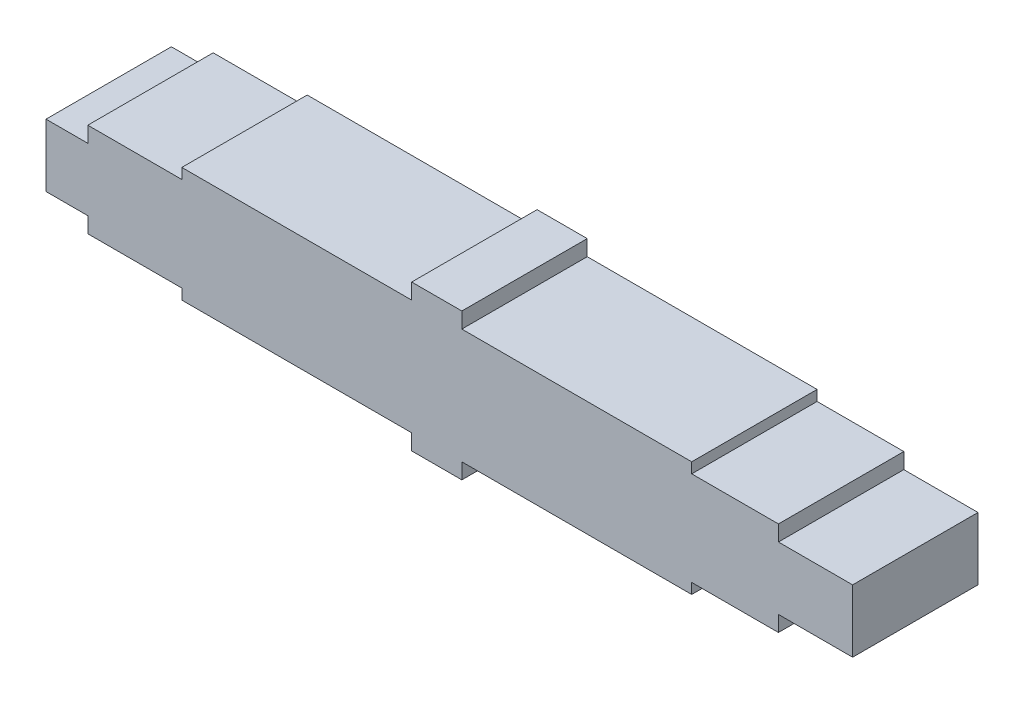
ISO-10303-21;
HEADER;
FILE_DESCRIPTION(('STEP AP214'),'2;1');
FILE_NAME('part.step','',(''),(''),'','','');
FILE_SCHEMA(('AUTOMOTIVE_DESIGN { 1 0 10303 214 1 1 1 1 }'));
ENDSEC;
DATA;
#1=APPLICATION_CONTEXT('core data for automotive mechanical design processes');
#2=APPLICATION_PROTOCOL_DEFINITION('international standard','automotive_design',2000,#1);
#3=PRODUCT_CONTEXT('',#1,'mechanical');
#4=PRODUCT('Part','Part','',(#3));
#5=PRODUCT_RELATED_PRODUCT_CATEGORY('part','',(#4));
#6=PRODUCT_DEFINITION_FORMATION('','',#4);
#7=PRODUCT_DEFINITION_CONTEXT('part definition',#1,'design');
#8=PRODUCT_DEFINITION('design','',#6,#7);
#9=PRODUCT_DEFINITION_SHAPE('','',#8);
#10=(LENGTH_UNIT() NAMED_UNIT(*) SI_UNIT(.MILLI.,.METRE.));
#11=(NAMED_UNIT(*) PLANE_ANGLE_UNIT() SI_UNIT($,.RADIAN.));
#12=(NAMED_UNIT(*) SI_UNIT($,.STERADIAN.) SOLID_ANGLE_UNIT());
#13=UNCERTAINTY_MEASURE_WITH_UNIT(LENGTH_MEASURE(1.E-05),#10,'distance_accuracy_value','');
#14=(GEOMETRIC_REPRESENTATION_CONTEXT(3) GLOBAL_UNCERTAINTY_ASSIGNED_CONTEXT((#13)) GLOBAL_UNIT_ASSIGNED_CONTEXT((#10,
#11,#12)) REPRESENTATION_CONTEXT('',''));
#15=CARTESIAN_POINT('',(0.,0.,0.));
#16=DIRECTION('',(0.,0.,1.));
#17=DIRECTION('',(1.,0.,0.));
#18=AXIS2_PLACEMENT_3D('',#15,#16,#17);
#19=CARTESIAN_POINT('',(53.,22.5,-30.));
#20=DIRECTION('',(1.,0.,0.));
#21=DIRECTION('',(0.,0.,-1.));
#22=AXIS2_PLACEMENT_3D('',#19,#20,#21);
#23=PLANE('',#22);
#24=DIRECTION('',(0.,0.,1.));
#25=VECTOR('',#24,1.);
#26=CARTESIAN_POINT('',(53.,22.5,-30.));
#27=LINE('',#26,#25);
#28=CARTESIAN_POINT('',(53.,22.5,-30.));
#29=VERTEX_POINT('',#28);
#30=CARTESIAN_POINT('',(53.,22.5,30.));
#31=VERTEX_POINT('',#30);
#32=EDGE_CURVE('E398',#29,#31,#27,.T.);
#33=ORIENTED_EDGE('',*,*,#32,.T.);
#34=DIRECTION('',(0.,1.,0.));
#35=VECTOR('',#34,1.);
#36=CARTESIAN_POINT('',(53.,22.5,30.));
#37=LINE('',#36,#35);
#38=CARTESIAN_POINT('',(53.,27.5,30.));
#39=VERTEX_POINT('',#38);
#40=EDGE_CURVE('E247',#31,#39,#37,.T.);
#41=ORIENTED_EDGE('',*,*,#40,.T.);
#42=DIRECTION('',(0.,0.,1.));
#43=VECTOR('',#42,1.);
#44=CARTESIAN_POINT('',(53.,27.5,-30.));
#45=LINE('',#44,#43);
#46=CARTESIAN_POINT('',(53.,27.5,-30.));
#47=VERTEX_POINT('',#46);
#48=EDGE_CURVE('E11',#47,#39,#45,.T.);
#49=ORIENTED_EDGE('',*,*,#48,.F.);
#50=DIRECTION('',(0.,1.,0.));
#51=VECTOR('',#50,1.);
#52=CARTESIAN_POINT('',(53.,22.5,-30.));
#53=LINE('',#52,#51);
#54=EDGE_CURVE('E331',#29,#47,#53,.T.);
#55=ORIENTED_EDGE('',*,*,#54,.F.);
#56=EDGE_LOOP('',(#33,#41,#49,#55));
#57=FACE_BOUND('',#56,.T.);
#58=ADVANCED_FACE('F34',(#57),#23,.F.);
#59=CARTESIAN_POINT('',(53.,27.5,-30.));
#60=DIRECTION('',(0.,-1.,0.));
#61=DIRECTION('',(0.,0.,-1.));
#62=AXIS2_PLACEMENT_3D('',#59,#60,#61);
#63=PLANE('',#62);
#64=ORIENTED_EDGE('',*,*,#48,.T.);
#65=DIRECTION('',(1.,0.,0.));
#66=VECTOR('',#65,1.);
#67=CARTESIAN_POINT('',(53.,27.5,30.));
#68=LINE('',#67,#66);
#69=CARTESIAN_POINT('',(163.,27.5,30.));
#70=VERTEX_POINT('',#69);
#71=EDGE_CURVE('E250',#39,#70,#68,.T.);
#72=ORIENTED_EDGE('',*,*,#71,.T.);
#73=DIRECTION('',(0.,0.,1.));
#74=VECTOR('',#73,1.);
#75=CARTESIAN_POINT('',(163.,27.5,-30.));
#76=LINE('',#75,#74);
#77=CARTESIAN_POINT('',(163.,27.5,-30.));
#78=VERTEX_POINT('',#77);
#79=EDGE_CURVE('E41',#78,#70,#76,.T.);
#80=ORIENTED_EDGE('',*,*,#79,.F.);
#81=DIRECTION('',(1.,0.,0.));
#82=VECTOR('',#81,1.);
#83=CARTESIAN_POINT('',(53.,27.5,-30.));
#84=LINE('',#83,#82);
#85=EDGE_CURVE('E333',#47,#78,#84,.T.);
#86=ORIENTED_EDGE('',*,*,#85,.F.);
#87=EDGE_LOOP('',(#64,#72,#80,#86));
#88=FACE_BOUND('',#87,.T.);
#89=ADVANCED_FACE('F462',(#88),#63,.F.);
#90=CARTESIAN_POINT('',(163.,27.5,-30.));
#91=DIRECTION('',(1.,0.,0.));
#92=DIRECTION('',(0.,0.,-1.));
#93=AXIS2_PLACEMENT_3D('',#90,#91,#92);
#94=PLANE('',#93);
#95=ORIENTED_EDGE('',*,*,#79,.T.);
#96=DIRECTION('',(0.,1.,0.));
#97=VECTOR('',#96,1.);
#98=CARTESIAN_POINT('',(163.,27.5,30.));
#99=LINE('',#98,#97);
#100=CARTESIAN_POINT('',(163.,35.,30.));
#101=VERTEX_POINT('',#100);
#102=EDGE_CURVE('E253',#70,#101,#99,.T.);
#103=ORIENTED_EDGE('',*,*,#102,.T.);
#104=DIRECTION('',(0.,0.,1.));
#105=VECTOR('',#104,1.);
#106=CARTESIAN_POINT('',(163.,35.,-30.));
#107=LINE('',#106,#105);
#108=CARTESIAN_POINT('',(163.,35.,-30.));
#109=VERTEX_POINT('',#108);
#110=EDGE_CURVE('E448',#109,#101,#107,.T.);
#111=ORIENTED_EDGE('',*,*,#110,.F.);
#112=DIRECTION('',(0.,1.,0.));
#113=VECTOR('',#112,1.);
#114=CARTESIAN_POINT('',(163.,27.5,-30.));
#115=LINE('',#114,#113);
#116=EDGE_CURVE('E335',#78,#109,#115,.T.);
#117=ORIENTED_EDGE('',*,*,#116,.F.);
#118=EDGE_LOOP('',(#95,#103,#111,#117));
#119=FACE_BOUND('',#118,.T.);
#120=ADVANCED_FACE('F453',(#119),#94,.F.);
#121=CARTESIAN_POINT('',(163.,35.,-30.));
#122=DIRECTION('',(0.,-1.,0.));
#123=DIRECTION('',(0.,0.,-1.));
#124=AXIS2_PLACEMENT_3D('',#121,#122,#123);
#125=PLANE('',#124);
#126=ORIENTED_EDGE('',*,*,#110,.T.);
#127=DIRECTION('',(1.,0.,0.));
#128=VECTOR('',#127,1.);
#129=CARTESIAN_POINT('',(163.,35.,30.));
#130=LINE('',#129,#128);
#131=CARTESIAN_POINT('',(187.,35.,30.));
#132=VERTEX_POINT('',#131);
#133=EDGE_CURVE('E256',#101,#132,#130,.T.);
#134=ORIENTED_EDGE('',*,*,#133,.T.);
#135=DIRECTION('',(0.,0.,1.));
#136=VECTOR('',#135,1.);
#137=CARTESIAN_POINT('',(187.,35.,-30.));
#138=LINE('',#137,#136);
#139=CARTESIAN_POINT('',(187.,35.,-30.));
#140=VERTEX_POINT('',#139);
#141=EDGE_CURVE('E446',#140,#132,#138,.T.);
#142=ORIENTED_EDGE('',*,*,#141,.F.);
#143=DIRECTION('',(1.,0.,0.));
#144=VECTOR('',#143,1.);
#145=CARTESIAN_POINT('',(163.,35.,-30.));
#146=LINE('',#145,#144);
#147=EDGE_CURVE('E337',#109,#140,#146,.T.);
#148=ORIENTED_EDGE('',*,*,#147,.F.);
#149=EDGE_LOOP('',(#126,#134,#142,#148));
#150=FACE_BOUND('',#149,.T.);
#151=ADVANCED_FACE('F571',(#150),#125,.F.);
#152=CARTESIAN_POINT('',(187.,35.,-30.));
#153=DIRECTION('',(-1.,0.,0.));
#154=DIRECTION('',(0.,0.,1.));
#155=AXIS2_PLACEMENT_3D('',#152,#153,#154);
#156=PLANE('',#155);
#157=ORIENTED_EDGE('',*,*,#141,.T.);
#158=DIRECTION('',(0.,-1.,0.));
#159=VECTOR('',#158,1.);
#160=CARTESIAN_POINT('',(187.,35.,30.));
#161=LINE('',#160,#159);
#162=CARTESIAN_POINT('',(187.,27.5,30.));
#163=VERTEX_POINT('',#162);
#164=EDGE_CURVE('E259',#132,#163,#161,.T.);
#165=ORIENTED_EDGE('',*,*,#164,.T.);
#166=DIRECTION('',(0.,0.,1.));
#167=VECTOR('',#166,1.);
#168=CARTESIAN_POINT('',(187.,27.5,-30.));
#169=LINE('',#168,#167);
#170=CARTESIAN_POINT('',(187.,27.5,-30.));
#171=VERTEX_POINT('',#170);
#172=EDGE_CURVE('E444',#171,#163,#169,.T.);
#173=ORIENTED_EDGE('',*,*,#172,.F.);
#174=DIRECTION('',(0.,-1.,0.));
#175=VECTOR('',#174,1.);
#176=CARTESIAN_POINT('',(187.,35.,-30.));
#177=LINE('',#176,#175);
#178=EDGE_CURVE('E339',#140,#171,#177,.T.);
#179=ORIENTED_EDGE('',*,*,#178,.F.);
#180=EDGE_LOOP('',(#157,#165,#173,#179));
#181=FACE_BOUND('',#180,.T.);
#182=ADVANCED_FACE('F566',(#181),#156,.F.);
#183=CARTESIAN_POINT('',(187.,27.5,-30.));
#184=DIRECTION('',(0.,-1.,0.));
#185=DIRECTION('',(1.,0.,0.));
#186=AXIS2_PLACEMENT_3D('',#183,#184,#185);
#187=PLANE('',#186);
#188=ORIENTED_EDGE('',*,*,#172,.T.);
#189=DIRECTION('',(1.,0.,0.));
#190=VECTOR('',#189,1.);
#191=CARTESIAN_POINT('',(187.,27.5,30.));
#192=LINE('',#191,#190);
#193=CARTESIAN_POINT('',(297.,27.5,30.));
#194=VERTEX_POINT('',#193);
#195=EDGE_CURVE('E262',#163,#194,#192,.T.);
#196=ORIENTED_EDGE('',*,*,#195,.T.);
#197=DIRECTION('',(0.,0.,1.));
#198=VECTOR('',#197,1.);
#199=CARTESIAN_POINT('',(297.,27.5,-30.));
#200=LINE('',#199,#198);
#201=CARTESIAN_POINT('',(297.,27.5,-30.));
#202=VERTEX_POINT('',#201);
#203=EDGE_CURVE('E442',#202,#194,#200,.T.);
#204=ORIENTED_EDGE('',*,*,#203,.F.);
#205=DIRECTION('',(1.,0.,0.));
#206=VECTOR('',#205,1.);
#207=CARTESIAN_POINT('',(187.,27.5,-30.));
#208=LINE('',#207,#206);
#209=EDGE_CURVE('E341',#171,#202,#208,.T.);
#210=ORIENTED_EDGE('',*,*,#209,.F.);
#211=EDGE_LOOP('',(#188,#196,#204,#210));
#212=FACE_BOUND('',#211,.T.);
#213=ADVANCED_FACE('F563',(#212),#187,.F.);
#214=CARTESIAN_POINT('',(297.,27.5,-30.));
#215=DIRECTION('',(-1.,0.,0.));
#216=DIRECTION('',(0.,0.,1.));
#217=AXIS2_PLACEMENT_3D('',#214,#215,#216);
#218=PLANE('',#217);
#219=ORIENTED_EDGE('',*,*,#203,.T.);
#220=DIRECTION('',(0.,-1.,0.));
#221=VECTOR('',#220,1.);
#222=CARTESIAN_POINT('',(297.,27.5,30.));
#223=LINE('',#222,#221);
#224=CARTESIAN_POINT('',(297.,22.5,30.));
#225=VERTEX_POINT('',#224);
#226=EDGE_CURVE('E265',#194,#225,#223,.T.);
#227=ORIENTED_EDGE('',*,*,#226,.T.);
#228=DIRECTION('',(0.,0.,1.));
#229=VECTOR('',#228,1.);
#230=CARTESIAN_POINT('',(297.,22.5,-30.));
#231=LINE('',#230,#229);
#232=CARTESIAN_POINT('',(297.,22.5,-30.));
#233=VERTEX_POINT('',#232);
#234=EDGE_CURVE('E440',#233,#225,#231,.T.);
#235=ORIENTED_EDGE('',*,*,#234,.F.);
#236=DIRECTION('',(0.,-1.,0.));
#237=VECTOR('',#236,1.);
#238=CARTESIAN_POINT('',(297.,27.5,-30.));
#239=LINE('',#238,#237);
#240=EDGE_CURVE('E343',#202,#233,#239,.T.);
#241=ORIENTED_EDGE('',*,*,#240,.F.);
#242=EDGE_LOOP('',(#219,#227,#235,#241));
#243=FACE_BOUND('',#242,.T.);
#244=ADVANCED_FACE('F558',(#243),#218,.F.);
#245=CARTESIAN_POINT('',(297.,22.5,-30.));
#246=DIRECTION('',(0.,-1.,0.));
#247=DIRECTION('',(0.,0.,-1.));
#248=AXIS2_PLACEMENT_3D('',#245,#246,#247);
#249=PLANE('',#248);
#250=ORIENTED_EDGE('',*,*,#234,.T.);
#251=DIRECTION('',(1.,0.,0.));
#252=VECTOR('',#251,1.);
#253=CARTESIAN_POINT('',(297.,22.5,30.));
#254=LINE('',#253,#252);
#255=CARTESIAN_POINT('',(338.5,22.5,30.));
#256=VERTEX_POINT('',#255);
#257=EDGE_CURVE('E268',#225,#256,#254,.T.);
#258=ORIENTED_EDGE('',*,*,#257,.T.);
#259=DIRECTION('',(0.,0.,1.));
#260=VECTOR('',#259,1.);
#261=CARTESIAN_POINT('',(338.5,22.5,-30.));
#262=LINE('',#261,#260);
#263=CARTESIAN_POINT('',(338.5,22.5,-30.));
#264=VERTEX_POINT('',#263);
#265=EDGE_CURVE('E438',#264,#256,#262,.T.);
#266=ORIENTED_EDGE('',*,*,#265,.F.);
#267=DIRECTION('',(1.,0.,0.));
#268=VECTOR('',#267,1.);
#269=CARTESIAN_POINT('',(297.,22.5,-30.));
#270=LINE('',#269,#268);
#271=EDGE_CURVE('E345',#233,#264,#270,.T.);
#272=ORIENTED_EDGE('',*,*,#271,.F.);
#273=EDGE_LOOP('',(#250,#258,#266,#272));
#274=FACE_BOUND('',#273,.T.);
#275=ADVANCED_FACE('F553',(#274),#249,.F.);
#276=CARTESIAN_POINT('',(338.5,22.5,-30.));
#277=DIRECTION('',(-1.,0.,0.));
#278=DIRECTION('',(0.,0.,1.));
#279=AXIS2_PLACEMENT_3D('',#276,#277,#278);
#280=PLANE('',#279);
#281=ORIENTED_EDGE('',*,*,#265,.T.);
#282=DIRECTION('',(0.,-1.,0.));
#283=VECTOR('',#282,1.);
#284=CARTESIAN_POINT('',(338.5,22.5,30.));
#285=LINE('',#284,#283);
#286=CARTESIAN_POINT('',(338.5,15.,30.));
#287=VERTEX_POINT('',#286);
#288=EDGE_CURVE('E271',#256,#287,#285,.T.);
#289=ORIENTED_EDGE('',*,*,#288,.T.);
#290=DIRECTION('',(0.,0.,1.));
#291=VECTOR('',#290,1.);
#292=CARTESIAN_POINT('',(338.5,15.,-30.));
#293=LINE('',#292,#291);
#294=CARTESIAN_POINT('',(338.5,15.,-30.));
#295=VERTEX_POINT('',#294);
#296=EDGE_CURVE('E436',#295,#287,#293,.T.);
#297=ORIENTED_EDGE('',*,*,#296,.F.);
#298=DIRECTION('',(0.,-1.,0.));
#299=VECTOR('',#298,1.);
#300=CARTESIAN_POINT('',(338.5,22.5,-30.));
#301=LINE('',#300,#299);
#302=EDGE_CURVE('E347',#264,#295,#301,.T.);
#303=ORIENTED_EDGE('',*,*,#302,.F.);
#304=EDGE_LOOP('',(#281,#289,#297,#303));
#305=FACE_BOUND('',#304,.T.);
#306=ADVANCED_FACE('F548',(#305),#280,.F.);
#307=CARTESIAN_POINT('',(338.5,15.,-30.));
#308=DIRECTION('',(0.,-1.,0.));
#309=DIRECTION('',(1.,0.,0.));
#310=AXIS2_PLACEMENT_3D('',#307,#308,#309);
#311=PLANE('',#310);
#312=ORIENTED_EDGE('',*,*,#296,.T.);
#313=DIRECTION('',(1.,0.,0.));
#314=VECTOR('',#313,1.);
#315=CARTESIAN_POINT('',(338.5,15.,30.));
#316=LINE('',#315,#314);
#317=CARTESIAN_POINT('',(374.,15.,30.));
#318=VERTEX_POINT('',#317);
#319=EDGE_CURVE('E274',#287,#318,#316,.T.);
#320=ORIENTED_EDGE('',*,*,#319,.T.);
#321=DIRECTION('',(0.,0.,1.));
#322=VECTOR('',#321,1.);
#323=CARTESIAN_POINT('',(374.,15.,-30.));
#324=LINE('',#323,#322);
#325=CARTESIAN_POINT('',(374.,15.,-30.));
#326=VERTEX_POINT('',#325);
#327=EDGE_CURVE('E434',#326,#318,#324,.T.);
#328=ORIENTED_EDGE('',*,*,#327,.F.);
#329=DIRECTION('',(1.,0.,0.));
#330=VECTOR('',#329,1.);
#331=CARTESIAN_POINT('',(338.5,15.,-30.));
#332=LINE('',#331,#330);
#333=EDGE_CURVE('E349',#295,#326,#332,.T.);
#334=ORIENTED_EDGE('',*,*,#333,.F.);
#335=EDGE_LOOP('',(#312,#320,#328,#334));
#336=FACE_BOUND('',#335,.T.);
#337=ADVANCED_FACE('F543',(#336),#311,.F.);
#338=CARTESIAN_POINT('',(374.,15.,-30.));
#339=DIRECTION('',(-1.,0.,0.));
#340=DIRECTION('',(0.,0.,1.));
#341=AXIS2_PLACEMENT_3D('',#338,#339,#340);
#342=PLANE('',#341);
#343=ORIENTED_EDGE('',*,*,#327,.T.);
#344=DIRECTION('',(0.,-1.,0.));
#345=VECTOR('',#344,1.);
#346=CARTESIAN_POINT('',(374.,15.,30.));
#347=LINE('',#346,#345);
#348=CARTESIAN_POINT('',(374.,-15.,30.));
#349=VERTEX_POINT('',#348);
#350=EDGE_CURVE('E277',#318,#349,#347,.T.);
#351=ORIENTED_EDGE('',*,*,#350,.T.);
#352=DIRECTION('',(0.,0.,1.));
#353=VECTOR('',#352,1.);
#354=CARTESIAN_POINT('',(374.,-15.,-30.));
#355=LINE('',#354,#353);
#356=CARTESIAN_POINT('',(374.,-15.,-30.));
#357=VERTEX_POINT('',#356);
#358=EDGE_CURVE('E432',#357,#349,#355,.T.);
#359=ORIENTED_EDGE('',*,*,#358,.F.);
#360=DIRECTION('',(0.,-1.,0.));
#361=VECTOR('',#360,1.);
#362=CARTESIAN_POINT('',(374.,15.,-30.));
#363=LINE('',#362,#361);
#364=EDGE_CURVE('E351',#326,#357,#363,.T.);
#365=ORIENTED_EDGE('',*,*,#364,.F.);
#366=EDGE_LOOP('',(#343,#351,#359,#365));
#367=FACE_BOUND('',#366,.T.);
#368=ADVANCED_FACE('F539',(#367),#342,.F.);
#369=CARTESIAN_POINT('',(338.5,-15.,-30.));
#370=DIRECTION('',(0.,-1.,0.));
#371=DIRECTION('',(1.,0.,0.));
#372=AXIS2_PLACEMENT_3D('',#369,#370,#371);
#373=PLANE('',#372);
#374=ORIENTED_EDGE('',*,*,#358,.T.);
#375=DIRECTION('',(1.,0.,0.));
#376=VECTOR('',#375,1.);
#377=CARTESIAN_POINT('',(338.5,-15.,30.));
#378=LINE('',#377,#376);
#379=CARTESIAN_POINT('',(338.5,-15.,30.));
#380=VERTEX_POINT('',#379);
#381=EDGE_CURVE('E280',#380,#349,#378,.T.);
#382=ORIENTED_EDGE('',*,*,#381,.F.);
#383=DIRECTION('',(0.,0.,1.));
#384=VECTOR('',#383,1.);
#385=CARTESIAN_POINT('',(338.5,-15.,-30.));
#386=LINE('',#385,#384);
#387=CARTESIAN_POINT('',(338.5,-15.,-30.));
#388=VERTEX_POINT('',#387);
#389=EDGE_CURVE('E430',#388,#380,#386,.T.);
#390=ORIENTED_EDGE('',*,*,#389,.F.);
#391=DIRECTION('',(1.,0.,0.));
#392=VECTOR('',#391,1.);
#393=CARTESIAN_POINT('',(338.5,-15.,-30.));
#394=LINE('',#393,#392);
#395=EDGE_CURVE('E353',#388,#357,#394,.T.);
#396=ORIENTED_EDGE('',*,*,#395,.T.);
#397=EDGE_LOOP('',(#374,#382,#390,#396));
#398=FACE_BOUND('',#397,.T.);
#399=ADVANCED_FACE('F534',(#398),#373,.T.);
#400=CARTESIAN_POINT('',(338.5,-22.5,-30.));
#401=DIRECTION('',(1.,0.,0.));
#402=DIRECTION('',(0.,0.,-1.));
#403=AXIS2_PLACEMENT_3D('',#400,#401,#402);
#404=PLANE('',#403);
#405=ORIENTED_EDGE('',*,*,#389,.T.);
#406=DIRECTION('',(0.,1.,0.));
#407=VECTOR('',#406,1.);
#408=CARTESIAN_POINT('',(338.5,-22.5,30.));
#409=LINE('',#408,#407);
#410=CARTESIAN_POINT('',(338.5,-22.5,30.));
#411=VERTEX_POINT('',#410);
#412=EDGE_CURVE('E283',#411,#380,#409,.T.);
#413=ORIENTED_EDGE('',*,*,#412,.F.);
#414=DIRECTION('',(0.,0.,1.));
#415=VECTOR('',#414,1.);
#416=CARTESIAN_POINT('',(338.5,-22.5,-30.));
#417=LINE('',#416,#415);
#418=CARTESIAN_POINT('',(338.5,-22.5,-30.));
#419=VERTEX_POINT('',#418);
#420=EDGE_CURVE('E428',#419,#411,#417,.T.);
#421=ORIENTED_EDGE('',*,*,#420,.F.);
#422=DIRECTION('',(0.,1.,0.));
#423=VECTOR('',#422,1.);
#424=CARTESIAN_POINT('',(338.5,-22.5,-30.));
#425=LINE('',#424,#423);
#426=EDGE_CURVE('E356',#419,#388,#425,.T.);
#427=ORIENTED_EDGE('',*,*,#426,.T.);
#428=EDGE_LOOP('',(#405,#413,#421,#427));
#429=FACE_BOUND('',#428,.T.);
#430=ADVANCED_FACE('F529',(#429),#404,.T.);
#431=CARTESIAN_POINT('',(297.,-22.5,-30.));
#432=DIRECTION('',(0.,-1.,0.));
#433=DIRECTION('',(0.,0.,-1.));
#434=AXIS2_PLACEMENT_3D('',#431,#432,#433);
#435=PLANE('',#434);
#436=ORIENTED_EDGE('',*,*,#420,.T.);
#437=DIRECTION('',(1.,0.,0.));
#438=VECTOR('',#437,1.);
#439=CARTESIAN_POINT('',(297.,-22.5,30.));
#440=LINE('',#439,#438);
#441=CARTESIAN_POINT('',(297.,-22.5,30.));
#442=VERTEX_POINT('',#441);
#443=EDGE_CURVE('E286',#442,#411,#440,.T.);
#444=ORIENTED_EDGE('',*,*,#443,.F.);
#445=DIRECTION('',(0.,0.,1.));
#446=VECTOR('',#445,1.);
#447=CARTESIAN_POINT('',(297.,-22.5,-30.));
#448=LINE('',#447,#446);
#449=CARTESIAN_POINT('',(297.,-22.5,-30.));
#450=VERTEX_POINT('',#449);
#451=EDGE_CURVE('E426',#450,#442,#448,.T.);
#452=ORIENTED_EDGE('',*,*,#451,.F.);
#453=DIRECTION('',(1.,0.,0.));
#454=VECTOR('',#453,1.);
#455=CARTESIAN_POINT('',(297.,-22.5,-30.));
#456=LINE('',#455,#454);
#457=EDGE_CURVE('E359',#450,#419,#456,.T.);
#458=ORIENTED_EDGE('',*,*,#457,.T.);
#459=EDGE_LOOP('',(#436,#444,#452,#458));
#460=FACE_BOUND('',#459,.T.);
#461=ADVANCED_FACE('F527',(#460),#435,.T.);
#462=CARTESIAN_POINT('',(297.,-27.5,-30.));
#463=DIRECTION('',(1.,0.,0.));
#464=DIRECTION('',(0.,0.,-1.));
#465=AXIS2_PLACEMENT_3D('',#462,#463,#464);
#466=PLANE('',#465);
#467=ORIENTED_EDGE('',*,*,#451,.T.);
#468=DIRECTION('',(0.,1.,0.));
#469=VECTOR('',#468,1.);
#470=CARTESIAN_POINT('',(297.,-27.5,30.));
#471=LINE('',#470,#469);
#472=CARTESIAN_POINT('',(297.,-27.5,30.));
#473=VERTEX_POINT('',#472);
#474=EDGE_CURVE('E289',#473,#442,#471,.T.);
#475=ORIENTED_EDGE('',*,*,#474,.F.);
#476=DIRECTION('',(0.,0.,1.));
#477=VECTOR('',#476,1.);
#478=CARTESIAN_POINT('',(297.,-27.5,-30.));
#479=LINE('',#478,#477);
#480=CARTESIAN_POINT('',(297.,-27.5,-30.));
#481=VERTEX_POINT('',#480);
#482=EDGE_CURVE('E424',#481,#473,#479,.T.);
#483=ORIENTED_EDGE('',*,*,#482,.F.);
#484=DIRECTION('',(0.,1.,0.));
#485=VECTOR('',#484,1.);
#486=CARTESIAN_POINT('',(297.,-27.5,-30.));
#487=LINE('',#486,#485);
#488=EDGE_CURVE('E362',#481,#450,#487,.T.);
#489=ORIENTED_EDGE('',*,*,#488,.T.);
#490=EDGE_LOOP('',(#467,#475,#483,#489));
#491=FACE_BOUND('',#490,.T.);
#492=ADVANCED_FACE('F522',(#491),#466,.T.);
#493=CARTESIAN_POINT('',(187.,-27.5,-30.));
#494=DIRECTION('',(0.,-1.,0.));
#495=DIRECTION('',(1.,0.,0.));
#496=AXIS2_PLACEMENT_3D('',#493,#494,#495);
#497=PLANE('',#496);
#498=ORIENTED_EDGE('',*,*,#482,.T.);
#499=DIRECTION('',(1.,0.,0.));
#500=VECTOR('',#499,1.);
#501=CARTESIAN_POINT('',(187.,-27.5,30.));
#502=LINE('',#501,#500);
#503=CARTESIAN_POINT('',(187.,-27.5,30.));
#504=VERTEX_POINT('',#503);
#505=EDGE_CURVE('E292',#504,#473,#502,.T.);
#506=ORIENTED_EDGE('',*,*,#505,.F.);
#507=DIRECTION('',(0.,0.,1.));
#508=VECTOR('',#507,1.);
#509=CARTESIAN_POINT('',(187.,-27.5,-30.));
#510=LINE('',#509,#508);
#511=CARTESIAN_POINT('',(187.,-27.5,-30.));
#512=VERTEX_POINT('',#511);
#513=EDGE_CURVE('E422',#512,#504,#510,.T.);
#514=ORIENTED_EDGE('',*,*,#513,.F.);
#515=DIRECTION('',(1.,0.,0.));
#516=VECTOR('',#515,1.);
#517=CARTESIAN_POINT('',(187.,-27.5,-30.));
#518=LINE('',#517,#516);
#519=EDGE_CURVE('E365',#512,#481,#518,.T.);
#520=ORIENTED_EDGE('',*,*,#519,.T.);
#521=EDGE_LOOP('',(#498,#506,#514,#520));
#522=FACE_BOUND('',#521,.T.);
#523=ADVANCED_FACE('F517',(#522),#497,.T.);
#524=CARTESIAN_POINT('',(187.,-35.,-30.));
#525=DIRECTION('',(1.,0.,0.));
#526=DIRECTION('',(0.,0.,-1.));
#527=AXIS2_PLACEMENT_3D('',#524,#525,#526);
#528=PLANE('',#527);
#529=ORIENTED_EDGE('',*,*,#513,.T.);
#530=DIRECTION('',(0.,1.,0.));
#531=VECTOR('',#530,1.);
#532=CARTESIAN_POINT('',(187.,-35.,30.));
#533=LINE('',#532,#531);
#534=CARTESIAN_POINT('',(187.,-35.,30.));
#535=VERTEX_POINT('',#534);
#536=EDGE_CURVE('E295',#535,#504,#533,.T.);
#537=ORIENTED_EDGE('',*,*,#536,.F.);
#538=DIRECTION('',(0.,0.,1.));
#539=VECTOR('',#538,1.);
#540=CARTESIAN_POINT('',(187.,-35.,-30.));
#541=LINE('',#540,#539);
#542=CARTESIAN_POINT('',(187.,-35.,-30.));
#543=VERTEX_POINT('',#542);
#544=EDGE_CURVE('E420',#543,#535,#541,.T.);
#545=ORIENTED_EDGE('',*,*,#544,.F.);
#546=DIRECTION('',(0.,1.,0.));
#547=VECTOR('',#546,1.);
#548=CARTESIAN_POINT('',(187.,-35.,-30.));
#549=LINE('',#548,#547);
#550=EDGE_CURVE('E368',#543,#512,#549,.T.);
#551=ORIENTED_EDGE('',*,*,#550,.T.);
#552=EDGE_LOOP('',(#529,#537,#545,#551));
#553=FACE_BOUND('',#552,.T.);
#554=ADVANCED_FACE('F515',(#553),#528,.T.);
#555=CARTESIAN_POINT('',(163.,-35.,-30.));
#556=DIRECTION('',(0.,-1.,0.));
#557=DIRECTION('',(0.,0.,-1.));
#558=AXIS2_PLACEMENT_3D('',#555,#556,#557);
#559=PLANE('',#558);
#560=ORIENTED_EDGE('',*,*,#544,.T.);
#561=DIRECTION('',(1.,0.,0.));
#562=VECTOR('',#561,1.);
#563=CARTESIAN_POINT('',(163.,-35.,30.));
#564=LINE('',#563,#562);
#565=CARTESIAN_POINT('',(163.,-35.,30.));
#566=VERTEX_POINT('',#565);
#567=EDGE_CURVE('E298',#566,#535,#564,.T.);
#568=ORIENTED_EDGE('',*,*,#567,.F.);
#569=DIRECTION('',(0.,0.,1.));
#570=VECTOR('',#569,1.);
#571=CARTESIAN_POINT('',(163.,-35.,-30.));
#572=LINE('',#571,#570);
#573=CARTESIAN_POINT('',(163.,-35.,-30.));
#574=VERTEX_POINT('',#573);
#575=EDGE_CURVE('E418',#574,#566,#572,.T.);
#576=ORIENTED_EDGE('',*,*,#575,.F.);
#577=DIRECTION('',(1.,0.,0.));
#578=VECTOR('',#577,1.);
#579=CARTESIAN_POINT('',(163.,-35.,-30.));
#580=LINE('',#579,#578);
#581=EDGE_CURVE('E371',#574,#543,#580,.T.);
#582=ORIENTED_EDGE('',*,*,#581,.T.);
#583=EDGE_LOOP('',(#560,#568,#576,#582));
#584=FACE_BOUND('',#583,.T.);
#585=ADVANCED_FACE('F510',(#584),#559,.T.);
#586=CARTESIAN_POINT('',(163.,-27.5,-30.));
#587=DIRECTION('',(-1.,0.,0.));
#588=DIRECTION('',(0.,0.,1.));
#589=AXIS2_PLACEMENT_3D('',#586,#587,#588);
#590=PLANE('',#589);
#591=ORIENTED_EDGE('',*,*,#575,.T.);
#592=DIRECTION('',(0.,-1.,0.));
#593=VECTOR('',#592,1.);
#594=CARTESIAN_POINT('',(163.,-27.5,30.));
#595=LINE('',#594,#593);
#596=CARTESIAN_POINT('',(163.,-27.5,30.));
#597=VERTEX_POINT('',#596);
#598=EDGE_CURVE('E301',#597,#566,#595,.T.);
#599=ORIENTED_EDGE('',*,*,#598,.F.);
#600=DIRECTION('',(0.,0.,1.));
#601=VECTOR('',#600,1.);
#602=CARTESIAN_POINT('',(163.,-27.5,-30.));
#603=LINE('',#602,#601);
#604=CARTESIAN_POINT('',(163.,-27.5,-30.));
#605=VERTEX_POINT('',#604);
#606=EDGE_CURVE('E416',#605,#597,#603,.T.);
#607=ORIENTED_EDGE('',*,*,#606,.F.);
#608=DIRECTION('',(0.,-1.,0.));
#609=VECTOR('',#608,1.);
#610=CARTESIAN_POINT('',(163.,-27.5,-30.));
#611=LINE('',#610,#609);
#612=EDGE_CURVE('E374',#605,#574,#611,.T.);
#613=ORIENTED_EDGE('',*,*,#612,.T.);
#614=EDGE_LOOP('',(#591,#599,#607,#613));
#615=FACE_BOUND('',#614,.T.);
#616=ADVANCED_FACE('F505',(#615),#590,.T.);
#617=CARTESIAN_POINT('',(53.,-27.5,-30.));
#618=DIRECTION('',(0.,-1.,0.));
#619=DIRECTION('',(0.,0.,-1.));
#620=AXIS2_PLACEMENT_3D('',#617,#618,#619);
#621=PLANE('',#620);
#622=ORIENTED_EDGE('',*,*,#606,.T.);
#623=DIRECTION('',(1.,0.,0.));
#624=VECTOR('',#623,1.);
#625=CARTESIAN_POINT('',(53.,-27.5,30.));
#626=LINE('',#625,#624);
#627=CARTESIAN_POINT('',(53.,-27.5,30.));
#628=VERTEX_POINT('',#627);
#629=EDGE_CURVE('E304',#628,#597,#626,.T.);
#630=ORIENTED_EDGE('',*,*,#629,.F.);
#631=DIRECTION('',(0.,0.,1.));
#632=VECTOR('',#631,1.);
#633=CARTESIAN_POINT('',(53.,-27.5,-30.));
#634=LINE('',#633,#632);
#635=CARTESIAN_POINT('',(53.,-27.5,-30.));
#636=VERTEX_POINT('',#635);
#637=EDGE_CURVE('E414',#636,#628,#634,.T.);
#638=ORIENTED_EDGE('',*,*,#637,.F.);
#639=DIRECTION('',(1.,0.,0.));
#640=VECTOR('',#639,1.);
#641=CARTESIAN_POINT('',(53.,-27.5,-30.));
#642=LINE('',#641,#640);
#643=EDGE_CURVE('E377',#636,#605,#642,.T.);
#644=ORIENTED_EDGE('',*,*,#643,.T.);
#645=EDGE_LOOP('',(#622,#630,#638,#644));
#646=FACE_BOUND('',#645,.T.);
#647=ADVANCED_FACE('F503',(#646),#621,.T.);
#648=CARTESIAN_POINT('',(53.,-22.5,-30.));
#649=DIRECTION('',(-1.,0.,0.));
#650=DIRECTION('',(0.,0.,1.));
#651=AXIS2_PLACEMENT_3D('',#648,#649,#650);
#652=PLANE('',#651);
#653=ORIENTED_EDGE('',*,*,#637,.T.);
#654=DIRECTION('',(0.,-1.,0.));
#655=VECTOR('',#654,1.);
#656=CARTESIAN_POINT('',(53.,-22.5,30.));
#657=LINE('',#656,#655);
#658=CARTESIAN_POINT('',(53.,-22.5,30.));
#659=VERTEX_POINT('',#658);
#660=EDGE_CURVE('E307',#659,#628,#657,.T.);
#661=ORIENTED_EDGE('',*,*,#660,.F.);
#662=DIRECTION('',(0.,0.,1.));
#663=VECTOR('',#662,1.);
#664=CARTESIAN_POINT('',(53.,-22.5,-30.));
#665=LINE('',#664,#663);
#666=CARTESIAN_POINT('',(53.,-22.5,-30.));
#667=VERTEX_POINT('',#666);
#668=EDGE_CURVE('E412',#667,#659,#665,.T.);
#669=ORIENTED_EDGE('',*,*,#668,.F.);
#670=DIRECTION('',(0.,-1.,0.));
#671=VECTOR('',#670,1.);
#672=CARTESIAN_POINT('',(53.,-22.5,-30.));
#673=LINE('',#672,#671);
#674=EDGE_CURVE('E380',#667,#636,#673,.T.);
#675=ORIENTED_EDGE('',*,*,#674,.T.);
#676=EDGE_LOOP('',(#653,#661,#669,#675));
#677=FACE_BOUND('',#676,.T.);
#678=ADVANCED_FACE('F498',(#677),#652,.T.);
#679=CARTESIAN_POINT('',(8.,-22.5,-30.));
#680=DIRECTION('',(0.,-1.,0.));
#681=DIRECTION('',(0.,0.,-1.));
#682=AXIS2_PLACEMENT_3D('',#679,#680,#681);
#683=PLANE('',#682);
#684=ORIENTED_EDGE('',*,*,#668,.T.);
#685=DIRECTION('',(1.,0.,0.));
#686=VECTOR('',#685,1.);
#687=CARTESIAN_POINT('',(8.,-22.5,30.));
#688=LINE('',#687,#686);
#689=CARTESIAN_POINT('',(8.,-22.5,30.));
#690=VERTEX_POINT('',#689);
#691=EDGE_CURVE('E310',#690,#659,#688,.T.);
#692=ORIENTED_EDGE('',*,*,#691,.F.);
#693=DIRECTION('',(0.,0.,1.));
#694=VECTOR('',#693,1.);
#695=CARTESIAN_POINT('',(8.,-22.5,-30.));
#696=LINE('',#695,#694);
#697=CARTESIAN_POINT('',(8.,-22.5,-30.));
#698=VERTEX_POINT('',#697);
#699=EDGE_CURVE('E410',#698,#690,#696,.T.);
#700=ORIENTED_EDGE('',*,*,#699,.F.);
#701=DIRECTION('',(1.,0.,0.));
#702=VECTOR('',#701,1.);
#703=CARTESIAN_POINT('',(8.,-22.5,-30.));
#704=LINE('',#703,#702);
#705=EDGE_CURVE('E383',#698,#667,#704,.T.);
#706=ORIENTED_EDGE('',*,*,#705,.T.);
#707=EDGE_LOOP('',(#684,#692,#700,#706));
#708=FACE_BOUND('',#707,.T.);
#709=ADVANCED_FACE('F492',(#708),#683,.T.);
#710=CARTESIAN_POINT('',(8.,-15.,-30.));
#711=DIRECTION('',(-1.,0.,0.));
#712=DIRECTION('',(0.,0.,1.));
#713=AXIS2_PLACEMENT_3D('',#710,#711,#712);
#714=PLANE('',#713);
#715=ORIENTED_EDGE('',*,*,#699,.T.);
#716=DIRECTION('',(0.,-1.,0.));
#717=VECTOR('',#716,1.);
#718=CARTESIAN_POINT('',(8.,-15.,30.));
#719=LINE('',#718,#717);
#720=CARTESIAN_POINT('',(8.,-15.,30.));
#721=VERTEX_POINT('',#720);
#722=EDGE_CURVE('E313',#721,#690,#719,.T.);
#723=ORIENTED_EDGE('',*,*,#722,.F.);
#724=DIRECTION('',(0.,0.,1.));
#725=VECTOR('',#724,1.);
#726=CARTESIAN_POINT('',(8.,-15.,-30.));
#727=LINE('',#726,#725);
#728=CARTESIAN_POINT('',(8.,-15.,-30.));
#729=VERTEX_POINT('',#728);
#730=EDGE_CURVE('E408',#729,#721,#727,.T.);
#731=ORIENTED_EDGE('',*,*,#730,.F.);
#732=DIRECTION('',(0.,-1.,0.));
#733=VECTOR('',#732,1.);
#734=CARTESIAN_POINT('',(8.,-15.,-30.));
#735=LINE('',#734,#733);
#736=EDGE_CURVE('E386',#729,#698,#735,.T.);
#737=ORIENTED_EDGE('',*,*,#736,.T.);
#738=EDGE_LOOP('',(#715,#723,#731,#737));
#739=FACE_BOUND('',#738,.T.);
#740=ADVANCED_FACE('F488',(#739),#714,.T.);
#741=CARTESIAN_POINT('',(-12.,-15.,-30.));
#742=DIRECTION('',(0.,-1.,0.));
#743=DIRECTION('',(0.,0.,-1.));
#744=AXIS2_PLACEMENT_3D('',#741,#742,#743);
#745=PLANE('',#744);
#746=ORIENTED_EDGE('',*,*,#730,.T.);
#747=DIRECTION('',(1.,0.,0.));
#748=VECTOR('',#747,1.);
#749=CARTESIAN_POINT('',(-12.,-15.,30.));
#750=LINE('',#749,#748);
#751=CARTESIAN_POINT('',(-12.,-15.,30.));
#752=VERTEX_POINT('',#751);
#753=EDGE_CURVE('E316',#752,#721,#750,.T.);
#754=ORIENTED_EDGE('',*,*,#753,.F.);
#755=DIRECTION('',(0.,0.,1.));
#756=VECTOR('',#755,1.);
#757=CARTESIAN_POINT('',(-12.,-15.,-30.));
#758=LINE('',#757,#756);
#759=CARTESIAN_POINT('',(-12.,-15.,-30.));
#760=VERTEX_POINT('',#759);
#761=EDGE_CURVE('E406',#760,#752,#758,.T.);
#762=ORIENTED_EDGE('',*,*,#761,.F.);
#763=DIRECTION('',(1.,0.,0.));
#764=VECTOR('',#763,1.);
#765=CARTESIAN_POINT('',(-12.,-15.,-30.));
#766=LINE('',#765,#764);
#767=EDGE_CURVE('E389',#760,#729,#766,.T.);
#768=ORIENTED_EDGE('',*,*,#767,.T.);
#769=EDGE_LOOP('',(#746,#754,#762,#768));
#770=FACE_BOUND('',#769,.T.);
#771=ADVANCED_FACE('F745',(#770),#745,.T.);
#772=CARTESIAN_POINT('',(-12.,-15.,-30.));
#773=DIRECTION('',(1.,0.,0.));
#774=DIRECTION('',(0.,0.,-1.));
#775=AXIS2_PLACEMENT_3D('',#772,#773,#774);
#776=PLANE('',#775);
#777=ORIENTED_EDGE('',*,*,#761,.T.);
#778=DIRECTION('',(0.,1.,0.));
#779=VECTOR('',#778,1.);
#780=CARTESIAN_POINT('',(-12.,-15.,30.));
#781=LINE('',#780,#779);
#782=CARTESIAN_POINT('',(-12.,15.,30.));
#783=VERTEX_POINT('',#782);
#784=EDGE_CURVE('E319',#752,#783,#781,.T.);
#785=ORIENTED_EDGE('',*,*,#784,.T.);
#786=DIRECTION('',(0.,0.,1.));
#787=VECTOR('',#786,1.);
#788=CARTESIAN_POINT('',(-12.,15.,-30.));
#789=LINE('',#788,#787);
#790=CARTESIAN_POINT('',(-12.,15.,-30.));
#791=VERTEX_POINT('',#790);
#792=EDGE_CURVE('E404',#791,#783,#789,.T.);
#793=ORIENTED_EDGE('',*,*,#792,.F.);
#794=DIRECTION('',(0.,1.,0.));
#795=VECTOR('',#794,1.);
#796=CARTESIAN_POINT('',(-12.,-15.,-30.));
#797=LINE('',#796,#795);
#798=EDGE_CURVE('E392',#760,#791,#797,.T.);
#799=ORIENTED_EDGE('',*,*,#798,.F.);
#800=EDGE_LOOP('',(#777,#785,#793,#799));
#801=FACE_BOUND('',#800,.T.);
#802=ADVANCED_FACE('F481',(#801),#776,.F.);
#803=CARTESIAN_POINT('',(-12.,15.,-30.));
#804=DIRECTION('',(0.,-1.,0.));
#805=DIRECTION('',(0.,0.,-1.));
#806=AXIS2_PLACEMENT_3D('',#803,#804,#805);
#807=PLANE('',#806);
#808=ORIENTED_EDGE('',*,*,#792,.T.);
#809=DIRECTION('',(1.,0.,0.));
#810=VECTOR('',#809,1.);
#811=CARTESIAN_POINT('',(-12.,15.,30.));
#812=LINE('',#811,#810);
#813=CARTESIAN_POINT('',(8.,15.,30.));
#814=VERTEX_POINT('',#813);
#815=EDGE_CURVE('E322',#783,#814,#812,.T.);
#816=ORIENTED_EDGE('',*,*,#815,.T.);
#817=DIRECTION('',(0.,0.,1.));
#818=VECTOR('',#817,1.);
#819=CARTESIAN_POINT('',(8.,15.,-30.));
#820=LINE('',#819,#818);
#821=CARTESIAN_POINT('',(8.,15.,-30.));
#822=VERTEX_POINT('',#821);
#823=EDGE_CURVE('E402',#822,#814,#820,.T.);
#824=ORIENTED_EDGE('',*,*,#823,.F.);
#825=DIRECTION('',(1.,0.,0.));
#826=VECTOR('',#825,1.);
#827=CARTESIAN_POINT('',(-12.,15.,-30.));
#828=LINE('',#827,#826);
#829=EDGE_CURVE('E394',#791,#822,#828,.T.);
#830=ORIENTED_EDGE('',*,*,#829,.F.);
#831=EDGE_LOOP('',(#808,#816,#824,#830));
#832=FACE_BOUND('',#831,.T.);
#833=ADVANCED_FACE('F476',(#832),#807,.F.);
#834=CARTESIAN_POINT('',(8.,15.,-30.));
#835=DIRECTION('',(1.,0.,0.));
#836=DIRECTION('',(0.,0.,-1.));
#837=AXIS2_PLACEMENT_3D('',#834,#835,#836);
#838=PLANE('',#837);
#839=ORIENTED_EDGE('',*,*,#823,.T.);
#840=DIRECTION('',(0.,1.,0.));
#841=VECTOR('',#840,1.);
#842=CARTESIAN_POINT('',(8.,15.,30.));
#843=LINE('',#842,#841);
#844=CARTESIAN_POINT('',(8.,22.5,30.));
#845=VERTEX_POINT('',#844);
#846=EDGE_CURVE('E325',#814,#845,#843,.T.);
#847=ORIENTED_EDGE('',*,*,#846,.T.);
#848=DIRECTION('',(0.,0.,1.));
#849=VECTOR('',#848,1.);
#850=CARTESIAN_POINT('',(8.,22.5,-30.));
#851=LINE('',#850,#849);
#852=CARTESIAN_POINT('',(8.,22.5,-30.));
#853=VERTEX_POINT('',#852);
#854=EDGE_CURVE('E400',#853,#845,#851,.T.);
#855=ORIENTED_EDGE('',*,*,#854,.F.);
#856=DIRECTION('',(0.,1.,0.));
#857=VECTOR('',#856,1.);
#858=CARTESIAN_POINT('',(8.,15.,-30.));
#859=LINE('',#858,#857);
#860=EDGE_CURVE('E53',#822,#853,#859,.T.);
#861=ORIENTED_EDGE('',*,*,#860,.F.);
#862=EDGE_LOOP('',(#839,#847,#855,#861));
#863=FACE_BOUND('',#862,.T.);
#864=ADVANCED_FACE('F471',(#863),#838,.F.);
#865=CARTESIAN_POINT('',(8.,22.5,-30.));
#866=DIRECTION('',(0.,-1.,0.));
#867=DIRECTION('',(0.,0.,-1.));
#868=AXIS2_PLACEMENT_3D('',#865,#866,#867);
#869=PLANE('',#868);
#870=ORIENTED_EDGE('',*,*,#854,.T.);
#871=DIRECTION('',(1.,0.,0.));
#872=VECTOR('',#871,1.);
#873=CARTESIAN_POINT('',(8.,22.5,30.));
#874=LINE('',#873,#872);
#875=EDGE_CURVE('E328',#845,#31,#874,.T.);
#876=ORIENTED_EDGE('',*,*,#875,.T.);
#877=ORIENTED_EDGE('',*,*,#32,.F.);
#878=DIRECTION('',(1.,0.,0.));
#879=VECTOR('',#878,1.);
#880=CARTESIAN_POINT('',(8.,22.5,-30.));
#881=LINE('',#880,#879);
#882=EDGE_CURVE('E48',#853,#29,#881,.T.);
#883=ORIENTED_EDGE('',*,*,#882,.F.);
#884=EDGE_LOOP('',(#870,#876,#877,#883));
#885=FACE_BOUND('',#884,.T.);
#886=ADVANCED_FACE('F469',(#885),#869,.F.);
#887=CARTESIAN_POINT('',(0.,0.,-30.));
#888=DIRECTION('',(0.,0.,-1.));
#889=DIRECTION('',(-1.,0.,0.));
#890=AXIS2_PLACEMENT_3D('',#887,#888,#889);
#891=PLANE('',#890);
#892=ORIENTED_EDGE('',*,*,#54,.T.);
#893=ORIENTED_EDGE('',*,*,#85,.T.);
#894=ORIENTED_EDGE('',*,*,#116,.T.);
#895=ORIENTED_EDGE('',*,*,#147,.T.);
#896=ORIENTED_EDGE('',*,*,#178,.T.);
#897=ORIENTED_EDGE('',*,*,#209,.T.);
#898=ORIENTED_EDGE('',*,*,#240,.T.);
#899=ORIENTED_EDGE('',*,*,#271,.T.);
#900=ORIENTED_EDGE('',*,*,#302,.T.);
#901=ORIENTED_EDGE('',*,*,#333,.T.);
#902=ORIENTED_EDGE('',*,*,#364,.T.);
#903=ORIENTED_EDGE('',*,*,#395,.F.);
#904=ORIENTED_EDGE('',*,*,#426,.F.);
#905=ORIENTED_EDGE('',*,*,#457,.F.);
#906=ORIENTED_EDGE('',*,*,#488,.F.);
#907=ORIENTED_EDGE('',*,*,#519,.F.);
#908=ORIENTED_EDGE('',*,*,#550,.F.);
#909=ORIENTED_EDGE('',*,*,#581,.F.);
#910=ORIENTED_EDGE('',*,*,#612,.F.);
#911=ORIENTED_EDGE('',*,*,#643,.F.);
#912=ORIENTED_EDGE('',*,*,#674,.F.);
#913=ORIENTED_EDGE('',*,*,#705,.F.);
#914=ORIENTED_EDGE('',*,*,#736,.F.);
#915=ORIENTED_EDGE('',*,*,#767,.F.);
#916=ORIENTED_EDGE('',*,*,#798,.T.);
#917=ORIENTED_EDGE('',*,*,#829,.T.);
#918=ORIENTED_EDGE('',*,*,#860,.T.);
#919=ORIENTED_EDGE('',*,*,#882,.T.);
#920=EDGE_LOOP('',(#892,#893,#894,#895,#896,#897,#898,#899,#900,#901,#902,#903,#904,#905,#906,
#907,#908,#909,#910,#911,#912,#913,#914,#915,#916,#917,#918,#919));
#921=FACE_BOUND('',#920,.T.);
#922=ADVANCED_FACE('F494',(#921),#891,.T.);
#923=CARTESIAN_POINT('',(0.,0.,30.));
#924=DIRECTION('',(0.,0.,-1.));
#925=DIRECTION('',(-1.,0.,0.));
#926=AXIS2_PLACEMENT_3D('',#923,#924,#925);
#927=PLANE('',#926);
#928=ORIENTED_EDGE('',*,*,#40,.F.);
#929=ORIENTED_EDGE('',*,*,#875,.F.);
#930=ORIENTED_EDGE('',*,*,#846,.F.);
#931=ORIENTED_EDGE('',*,*,#815,.F.);
#932=ORIENTED_EDGE('',*,*,#784,.F.);
#933=ORIENTED_EDGE('',*,*,#753,.T.);
#934=ORIENTED_EDGE('',*,*,#722,.T.);
#935=ORIENTED_EDGE('',*,*,#691,.T.);
#936=ORIENTED_EDGE('',*,*,#660,.T.);
#937=ORIENTED_EDGE('',*,*,#629,.T.);
#938=ORIENTED_EDGE('',*,*,#598,.T.);
#939=ORIENTED_EDGE('',*,*,#567,.T.);
#940=ORIENTED_EDGE('',*,*,#536,.T.);
#941=ORIENTED_EDGE('',*,*,#505,.T.);
#942=ORIENTED_EDGE('',*,*,#474,.T.);
#943=ORIENTED_EDGE('',*,*,#443,.T.);
#944=ORIENTED_EDGE('',*,*,#412,.T.);
#945=ORIENTED_EDGE('',*,*,#381,.T.);
#946=ORIENTED_EDGE('',*,*,#350,.F.);
#947=ORIENTED_EDGE('',*,*,#319,.F.);
#948=ORIENTED_EDGE('',*,*,#288,.F.);
#949=ORIENTED_EDGE('',*,*,#257,.F.);
#950=ORIENTED_EDGE('',*,*,#226,.F.);
#951=ORIENTED_EDGE('',*,*,#195,.F.);
#952=ORIENTED_EDGE('',*,*,#164,.F.);
#953=ORIENTED_EDGE('',*,*,#133,.F.);
#954=ORIENTED_EDGE('',*,*,#102,.F.);
#955=ORIENTED_EDGE('',*,*,#71,.F.);
#956=EDGE_LOOP('',(#928,#929,#930,#931,#932,#933,#934,#935,#936,#937,#938,#939,#940,#941,#942,
#943,#944,#945,#946,#947,#948,#949,#950,#951,#952,#953,#954,#955));
#957=FACE_BOUND('',#956,.T.);
#958=ADVANCED_FACE('F460',(#957),#927,.F.);
#959=CLOSED_SHELL('',(#58,#89,#120,#151,#182,#213,#244,#275,#306,#337,#368,#399,#430,#461,#492,
#523,#554,#585,#616,#647,#678,#709,#740,#771,#802,#833,#864,#886,#922,#958));
#960=CARTESIAN_POINT('',(108.000005707894,22.4952610342193,0.));
#961=CARTESIAN_POINT('',(106.98522103109,22.4248048884328,0.));
#962=CARTESIAN_POINT('',(104.949317870069,22.2820429774323,0.));
#963=CARTESIAN_POINT('',(101.588044864126,22.0432640255287,0.));
#964=CARTESIAN_POINT('',(98.7243774626749,21.8320830007476,0.));
#965=CARTESIAN_POINT('',(95.6979156892283,21.6075207343593,0.));
#966=CARTESIAN_POINT('',(93.6109408027448,21.4484940518401,0.));
#967=CARTESIAN_POINT('',(90.7607537735443,21.2295958391241,0.));
#968=CARTESIAN_POINT('',(87.4781874478426,20.9708929998984,0.));
#969=CARTESIAN_POINT('',(83.5640923368307,20.6545725271548,0.));
#970=CARTESIAN_POINT('',(79.1441917245338,20.2838499964215,0.));
#971=CARTESIAN_POINT('',(74.6972346151524,19.8971342995569,0.));
#972=CARTESIAN_POINT('',(70.2679882086389,19.4960984551638,0.));
#973=CARTESIAN_POINT('',(65.830769492056,19.0773560763188,0.));
#974=CARTESIAN_POINT('',(61.4007628940155,18.6399529956991,0.));
#975=CARTESIAN_POINT('',(55.8625798273647,18.0664296584203,0.));
#976=CARTESIAN_POINT('',(49.2237404627787,17.3300869942668,0.));
#977=CARTESIAN_POINT('',(41.4868629140933,16.3862682959262,0.));
#978=CARTESIAN_POINT('',(32.6660506975388,15.1492548221817,0.));
#979=CARTESIAN_POINT('',(24.2364987552846,13.7424429680365,0.));
#980=CARTESIAN_POINT('',(16.9997136615665,12.2361540286309,0.));
#981=CARTESIAN_POINT('',(11.3510078816937,10.7039656676967,0.));
#982=CARTESIAN_POINT('',(7.5001229961186,9.30746895943291,0.));
#983=CARTESIAN_POINT('',(5.17883547706022,8.21803018669558,0.));
#984=CARTESIAN_POINT('',(3.67793434009865,7.32726174196238,0.));
#985=CARTESIAN_POINT('',(2.65858358892872,6.57308193052102,0.));
#986=CARTESIAN_POINT('',(1.93956981292592,5.91717513897309,0.));
#987=CARTESIAN_POINT('',(1.40788982398583,5.31972054834848,0.));
#988=CARTESIAN_POINT('',(1.00292008619029,4.75468843987327,0.));
#989=CARTESIAN_POINT('',(0.687299533159101,4.19897777858402,0.));
#990=CARTESIAN_POINT('',(0.43616988960094,3.62223789491757,0.));
#991=CARTESIAN_POINT('',(0.23671983876913,2.98649357721549,0.));
#992=CARTESIAN_POINT('',(0.0895790310346846,2.24292923952444,0.));
#993=CARTESIAN_POINT('',(0.0228562942544542,1.52024332071269,0.));
#994=CARTESIAN_POINT('',(0.00229992176920339,0.841992826264919,0.));
#995=CARTESIAN_POINT('',(-0.000310819533643769,0.3608365881091,0.));
#996=CARTESIAN_POINT('',(-0.000355769799991507,0.120277326705554,0.));
#997=CARTESIAN_POINT('',(0.,0.,0.));
#998=B_SPLINE_CURVE_WITH_KNOTS('',4,(#960,#961,#962,#963,#964,#965,#966,#967,#968,#969,#970,
#971,#972,#973,#974,#975,#976,#977,#978,#979,#980,#981,#982,#983,#984,#985,#986,#987,#988,#989,
#990,#991,#992,#993,#994,#995,#996,#997),.UNSPECIFIED.,.F.,.F.,(5,1,1,1,1,1,1,1,1,1,1,1,1,1,1,1,
1,1,1,1,1,1,1,1,1,1,1,1,1,1,1,1,1,1,5),(0.,0.0355221162725867,0.0710442325451734,
0.0888052907135157,0.106566348881858,0.1243274070502,0.142088465218543,0.177610581636642,
0.213132698054741,0.248654814561742,0.284176931068744,0.319699047549615,0.355221164030486,
0.390743280367879,0.426265396705273,0.497309629266757,0.568353859369574,0.639398090922918,
0.710442316942991,0.7699240295869,0.80411031974507,0.82596167104612,0.84098141210895,
0.851621483146496,0.85970738851972,0.86634992324428,0.871980022968435,0.877092152715201,
0.88184719539092,0.886702686383255,0.89201377103823,0.898310059341884,0.905985320532747,
0.909822951128178,0.913660581723609),.UNSPECIFIED.);
#999=CARTESIAN_POINT('',(-1000.,0.,0.));
#1000=DIRECTION('',(-1.,0.,0.));
#1001=AXIS1_PLACEMENT('',#999,#1000);
#1002=SURFACE_OF_REVOLUTION('',#998,#1001);
#1003=CARTESIAN_POINT('',(0.,0.,0.));
#1004=VERTEX_POINT('',#1003);
#1005=VERTEX_LOOP('',#1004);
#1006=FACE_BOUND('',#1005,.T.);
#1007=CARTESIAN_POINT('',(108.000005707894,0.,0.));
#1008=DIRECTION('',(-1.,0.,0.));
#1009=DIRECTION('',(0.,0.,1.));
#1010=AXIS2_PLACEMENT_3D('',#1007,#1008,#1009);
#1011=CIRCLE('',#1010,22.4952610342193);
#1012=CARTESIAN_POINT('',(108.000005707894,0.,22.4952610342193));
#1013=VERTEX_POINT('',#1012);
#1014=EDGE_CURVE('E229',#1013,#1013,#1011,.T.);
#1015=ORIENTED_EDGE('',*,*,#1014,.F.);
#1016=EDGE_LOOP('',(#1015));
#1017=FACE_BOUND('',#1016,.T.);
#1018=ADVANCED_FACE('F221',(#1006,#1017),#1002,.F.);
#1019=CARTESIAN_POINT('',(350.,0.,0.));
#1020=CARTESIAN_POINT('',(350.000420526772,0.145847196817871,0.));
#1021=CARTESIAN_POINT('',(350.000343601262,0.437547407523126,0.));
#1022=CARTESIAN_POINT('',(349.99715907732,1.02099573004178,0.));
#1023=CARTESIAN_POINT('',(349.971487339376,1.84823422299089,0.));
#1024=CARTESIAN_POINT('',(349.887237793078,2.73604387511381,0.));
#1025=CARTESIAN_POINT('',(349.699673958908,3.65087401185043,0.));
#1026=CARTESIAN_POINT('',(349.440992029437,4.44172744651877,0.));
#1027=CARTESIAN_POINT('',(349.119004404855,5.14702184110903,0.));
#1028=CARTESIAN_POINT('',(348.723002975278,5.81394522298575,0.));
#1029=CARTESIAN_POINT('',(348.227306411294,6.47961012109771,0.));
#1030=CARTESIAN_POINT('',(347.594801697988,7.1713889141105,0.));
#1031=CARTESIAN_POINT('',(346.740922219264,7.93654539537142,0.));
#1032=CARTESIAN_POINT('',(345.557398761162,8.80275637014664,0.));
#1033=CARTESIAN_POINT('',(343.839526129327,9.82161042322062,0.));
#1034=CARTESIAN_POINT('',(341.314142899179,11.0192103161625,0.));
#1035=CARTESIAN_POINT('',(337.270373252642,12.5346774422666,0.));
#1036=CARTESIAN_POINT('',(331.522595168406,14.1826072318864,0.));
#1037=CARTESIAN_POINT('',(324.308730313301,15.802761995302,0.));
#1038=CARTESIAN_POINT('',(315.959550127336,17.3264287183842,0.));
#1039=CARTESIAN_POINT('',(308.389001930781,18.4987686146148,0.));
#1040=CARTESIAN_POINT('',(301.884553610341,19.4012216086554,0.));
#1041=CARTESIAN_POINT('',(295.372437906537,20.2375588181989,0.));
#1042=CARTESIAN_POINT('',(289.937964031543,20.8865488722375,0.));
#1043=CARTESIAN_POINT('',(284.502123722911,21.4957959178006,0.));
#1044=CARTESIAN_POINT('',(277.969218387664,22.1868060551331,0.));
#1045=CARTESIAN_POINT('',(272.530644227862,22.7316035557551,0.));
#1046=CARTESIAN_POINT('',(267.617740398063,23.1995817673955,0.));
#1047=CARTESIAN_POINT('',(263.272962125099,23.5975754870159,0.));
#1048=CARTESIAN_POINT('',(260.523519630538,23.8435236564505,0.));
#1049=CARTESIAN_POINT('',(258.395425805536,24.0315427144618,0.));
#1050=CARTESIAN_POINT('',(256.115950150791,24.2284011131277,0.));
#1051=CARTESIAN_POINT('',(254.096338206993,24.4019942604848,0.));
#1052=CARTESIAN_POINT('',(251.097793918415,24.6526302561606,0.));
#1053=CARTESIAN_POINT('',(248.314178962922,24.8841743639277,0.));
#1054=CARTESIAN_POINT('',(244.99078998065,25.1504562915564,0.));
#1055=CARTESIAN_POINT('',(242.997689398092,25.3081564535133,0.));
#1056=CARTESIAN_POINT('',(241.999996023264,25.3863284833665,0.));
#1057=B_SPLINE_CURVE_WITH_KNOTS('',4,(#1019,#1020,#1021,#1022,#1023,#1024,#1025,#1026,#1027,
#1028,#1029,#1030,#1031,#1032,#1033,#1034,#1035,#1036,#1037,#1038,#1039,#1040,#1041,#1042,#1043,
#1044,#1045,#1046,#1047,#1048,#1049,#1050,#1051,#1052,#1053,#1054,#1055,#1056),.UNSPECIFIED.,
.F.,.F.,(5,1,1,1,1,1,1,1,1,1,1,1,1,1,1,1,1,1,1,1,1,1,1,1,1,1,1,1,1,1,1,1,1,1,5),
(0.085539690582371,0.0901472370372938,0.0947547834922166,0.103969876402062,0.111681275618154,
0.118273857906504,0.124194080163128,0.130200796990666,0.136125527689018,0.142730953585443,
0.150369003842284,0.159763295913609,0.172288725506552,0.188989843095197,0.213373290810911,
0.247944866199644,0.308570143236632,0.377713118902858,0.446856104989694,0.515999091055385,
0.550570585246122,0.58514207943686,0.654285065499075,0.688856559078133,0.723428052657192,
0.792571038943038,0.827142532708429,0.844428279591124,0.861714026473819,0.878999773191567,
0.896285519909315,0.913571266627063,0.930857013344811,0.965428506672406,1.),.UNSPECIFIED.);
#1058=CARTESIAN_POINT('',(-1000.,0.,0.));
#1059=DIRECTION('',(-1.,0.,0.));
#1060=AXIS1_PLACEMENT('',#1058,#1059);
#1061=SURFACE_OF_REVOLUTION('',#1057,#1060);
#1062=CARTESIAN_POINT('',(241.999996023264,0.,0.));
#1063=DIRECTION('',(-1.,0.,0.));
#1064=DIRECTION('',(0.,0.,1.));
#1065=AXIS2_PLACEMENT_3D('',#1062,#1063,#1064);
#1066=CIRCLE('',#1065,25.3863284833665);
#1067=CARTESIAN_POINT('',(241.999996023264,0.,25.3863284833665));
#1068=VERTEX_POINT('',#1067);
#1069=EDGE_CURVE('E244',#1068,#1068,#1066,.T.);
#1070=ORIENTED_EDGE('',*,*,#1069,.T.);
#1071=EDGE_LOOP('',(#1070));
#1072=FACE_BOUND('',#1071,.T.);
#1073=CARTESIAN_POINT('',(350.,0.,0.));
#1074=VERTEX_POINT('',#1073);
#1075=VERTEX_LOOP('',#1074);
#1076=FACE_BOUND('',#1075,.T.);
#1077=ADVANCED_FACE('F224',(#1072,#1076),#1061,.F.);
#1078=CARTESIAN_POINT('',(241.999996023324,25.3863284833572,0.));
#1079=DIRECTION('',(-1.,0.,0.));
#1080=DIRECTION('',(0.,0.,1.));
#1081=AXIS2_PLACEMENT_3D('',#1078,#1079,#1080);
#1082=PLANE('',#1081);
#1083=CARTESIAN_POINT('',(241.999996023384,0.,0.));
#1084=DIRECTION('',(-1.,0.,0.));
#1085=DIRECTION('',(0.,0.,1.));
#1086=AXIS2_PLACEMENT_3D('',#1083,#1084,#1085);
#1087=CIRCLE('',#1086,26.4996369735634);
#1088=CARTESIAN_POINT('',(241.999996023384,0.,26.4996369735634));
#1089=VERTEX_POINT('',#1088);
#1090=EDGE_CURVE('E234',#1089,#1089,#1087,.T.);
#1091=ORIENTED_EDGE('',*,*,#1090,.T.);
#1092=EDGE_LOOP('',(#1091));
#1093=FACE_BOUND('',#1092,.T.);
#1094=ORIENTED_EDGE('',*,*,#1069,.F.);
#1095=EDGE_LOOP('',(#1094));
#1096=FACE_BOUND('',#1095,.T.);
#1097=ADVANCED_FACE('F816',(#1093,#1096),#1082,.T.);
#1098=CARTESIAN_POINT('',(241.999996023378,26.4996369735633,0.));
#1099=CARTESIAN_POINT('',(240.957024272852,26.4776314935916,0.));
#1100=CARTESIAN_POINT('',(238.874035778202,26.4336224843396,0.));
#1101=CARTESIAN_POINT('',(233.191375827555,26.313403617502,0.));
#1102=CARTESIAN_POINT('',(227.18153574013,26.1855288349748,0.));
#1103=CARTESIAN_POINT('',(218.243647000052,25.9948658854628,0.));
#1104=CARTESIAN_POINT('',(209.188065069239,25.8003607031106,0.));
#1105=CARTESIAN_POINT('',(198.91306630774,25.5789188034927,0.));
#1106=CARTESIAN_POINT('',(189.05933362675,25.3655294935979,0.));
#1107=CARTESIAN_POINT('',(178.945846595522,25.1460478781555,0.));
#1108=CARTESIAN_POINT('',(169.003951816323,24.9298285412714,0.));
#1109=CARTESIAN_POINT('',(158.933260023292,24.7108436288528,0.));
#1110=CARTESIAN_POINT('',(149.244027294232,24.5003576898128,0.));
#1111=CARTESIAN_POINT('',(140.669558614663,24.3147578931568,0.));
#1112=CARTESIAN_POINT('',(133.517001275577,24.1604899156798,0.));
#1113=CARTESIAN_POINT('',(127.386175821883,24.0289606171433,0.));
#1114=CARTESIAN_POINT('',(122.624130859648,23.9270667506707,0.));
#1115=CARTESIAN_POINT('',(117.52452678027,23.8187342107892,0.));
#1116=CARTESIAN_POINT('',(114.002675386447,23.7440553552497,0.));
#1117=CARTESIAN_POINT('',(110.134086752149,23.6626962405453,0.));
#1118=CARTESIAN_POINT('',(108.695322360152,23.6324925645588,0.));
#1119=CARTESIAN_POINT('',(108.000005707958,23.6179246115918,0.));
#1120=B_SPLINE_CURVE_WITH_KNOTS('',4,(#1098,#1099,#1100,#1101,#1102,#1103,#1104,#1105,#1106,
#1107,#1108,#1109,#1110,#1111,#1112,#1113,#1114,#1115,#1116,#1117,#1118,#1119),.UNSPECIFIED.,
.F.,.F.,(5,1,1,1,1,1,1,1,1,1,1,1,1,1,1,1,1,1,5),(0.0833321459843396,0.114465363152761,
0.145598580323218,0.195011085864555,0.257277520211031,0.319543954554675,0.381810388900396,
0.444076823245133,0.506343257590501,0.568609691935788,0.630876126281274,0.693142560626518,
0.748898563506022,0.780031780679036,0.811164997849129,0.842298215020905,0.873431432195839,
0.895911896430309,0.91666737453211),.UNSPECIFIED.);
#1121=CARTESIAN_POINT('',(-1000.,0.,0.));
#1122=DIRECTION('',(-1.,0.,0.));
#1123=AXIS1_PLACEMENT('',#1121,#1122);
#1124=SURFACE_OF_REVOLUTION('',#1120,#1123);
#1125=CARTESIAN_POINT('',(108.000005707958,0.,0.));
#1126=DIRECTION('',(-1.,0.,0.));
#1127=DIRECTION('',(0.,0.,1.));
#1128=AXIS2_PLACEMENT_3D('',#1125,#1126,#1127);
#1129=CIRCLE('',#1128,23.6179246115918);
#1130=CARTESIAN_POINT('',(108.000005707958,0.,23.6179246115918));
#1131=VERTEX_POINT('',#1130);
#1132=EDGE_CURVE('E231',#1131,#1131,#1129,.T.);
#1133=ORIENTED_EDGE('',*,*,#1132,.T.);
#1134=EDGE_LOOP('',(#1133));
#1135=FACE_BOUND('',#1134,.T.);
#1136=ORIENTED_EDGE('',*,*,#1090,.F.);
#1137=EDGE_LOOP('',(#1136));
#1138=FACE_BOUND('',#1137,.T.);
#1139=ADVANCED_FACE('F826',(#1135,#1138),#1124,.F.);
#1140=CARTESIAN_POINT('',(108.000005707926,22.4952610342193,0.));
#1141=DIRECTION('',(1.,0.,0.));
#1142=DIRECTION('',(0.,0.,-1.));
#1143=AXIS2_PLACEMENT_3D('',#1140,#1141,#1142);
#1144=PLANE('',#1143);
#1145=ORIENTED_EDGE('',*,*,#1014,.T.);
#1146=EDGE_LOOP('',(#1145));
#1147=FACE_BOUND('',#1146,.T.);
#1148=ORIENTED_EDGE('',*,*,#1132,.F.);
#1149=EDGE_LOOP('',(#1148));
#1150=FACE_BOUND('',#1149,.T.);
#1151=ADVANCED_FACE('F836',(#1147,#1150),#1144,.T.);
#1152=CLOSED_SHELL('',(#1018,#1077,#1097,#1139,#1151));
#1153=ORIENTED_CLOSED_SHELL('',*,#1152,.T.);
#1154=BREP_WITH_VOIDS('B2',#959,(#1153));
#1155=ADVANCED_BREP_SHAPE_REPRESENTATION('',(#18,#1154),#14);
#1156=SHAPE_DEFINITION_REPRESENTATION(#9,#1155);
ENDSEC;
END-ISO-10303-21;
